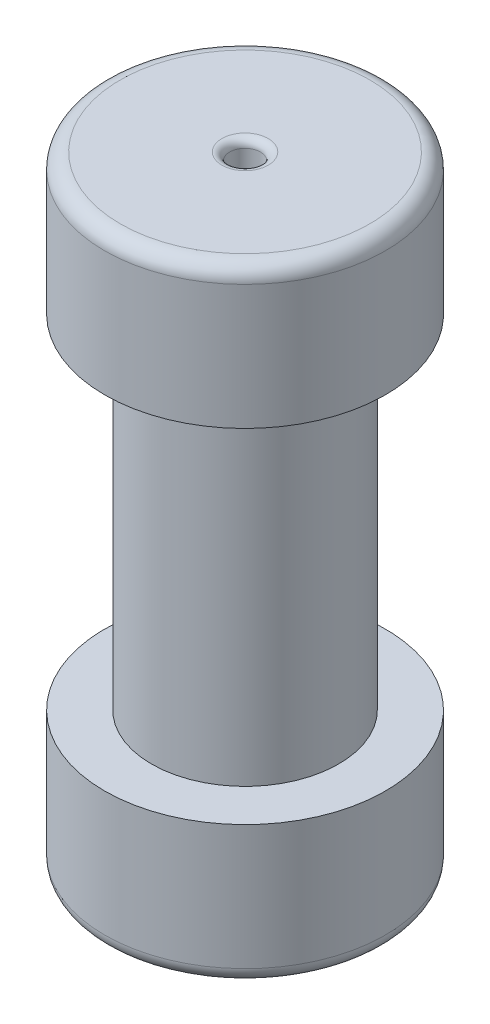
ISO-10303-21;
HEADER;
FILE_DESCRIPTION(('STEP AP214'),'2;1');
FILE_NAME('part.step','',(''),(''),'','','');
FILE_SCHEMA(('AUTOMOTIVE_DESIGN { 1 0 10303 214 1 1 1 1 }'));
ENDSEC;
DATA;
#1=APPLICATION_CONTEXT('core data for automotive mechanical design processes');
#2=APPLICATION_PROTOCOL_DEFINITION('international standard','automotive_design',2000,#1);
#3=PRODUCT_CONTEXT('',#1,'mechanical');
#4=PRODUCT('Part','Part','',(#3));
#5=PRODUCT_RELATED_PRODUCT_CATEGORY('part','',(#4));
#6=PRODUCT_DEFINITION_FORMATION('','',#4);
#7=PRODUCT_DEFINITION_CONTEXT('part definition',#1,'design');
#8=PRODUCT_DEFINITION('design','',#6,#7);
#9=PRODUCT_DEFINITION_SHAPE('','',#8);
#10=(LENGTH_UNIT() NAMED_UNIT(*) SI_UNIT(.MILLI.,.METRE.));
#11=(NAMED_UNIT(*) PLANE_ANGLE_UNIT() SI_UNIT($,.RADIAN.));
#12=(NAMED_UNIT(*) SI_UNIT($,.STERADIAN.) SOLID_ANGLE_UNIT());
#13=UNCERTAINTY_MEASURE_WITH_UNIT(LENGTH_MEASURE(1.E-05),#10,'distance_accuracy_value','');
#14=(GEOMETRIC_REPRESENTATION_CONTEXT(3) GLOBAL_UNCERTAINTY_ASSIGNED_CONTEXT((#13)) GLOBAL_UNIT_ASSIGNED_CONTEXT((#10,
#11,#12)) REPRESENTATION_CONTEXT('',''));
#15=CARTESIAN_POINT('',(0.,0.,0.));
#16=DIRECTION('',(0.,0.,1.));
#17=DIRECTION('',(1.,0.,0.));
#18=AXIS2_PLACEMENT_3D('',#15,#16,#17);
#19=CARTESIAN_POINT('',(0.,22.86,0.));
#20=DIRECTION('',(0.,-1.,0.));
#21=DIRECTION('',(0.,0.,-1.));
#22=AXIS2_PLACEMENT_3D('',#19,#20,#21);
#23=CYLINDRICAL_SURFACE('',#22,22.86);
#24=CARTESIAN_POINT('',(0.,2.54,0.));
#25=DIRECTION('',(0.,1.,0.));
#26=DIRECTION('',(0.,0.,1.));
#27=AXIS2_PLACEMENT_3D('',#24,#25,#26);
#28=CIRCLE('',#27,22.86);
#29=CARTESIAN_POINT('',(0.,2.54,22.86));
#30=VERTEX_POINT('',#29);
#31=EDGE_CURVE('E75',#30,#30,#28,.T.);
#32=ORIENTED_EDGE('',*,*,#31,.T.);
#33=EDGE_LOOP('',(#32));
#34=FACE_BOUND('',#33,.T.);
#35=CARTESIAN_POINT('',(0.,22.86,0.));
#36=DIRECTION('',(0.,1.,0.));
#37=DIRECTION('',(0.,0.,1.));
#38=AXIS2_PLACEMENT_3D('',#35,#36,#37);
#39=CIRCLE('',#38,22.86);
#40=CARTESIAN_POINT('',(0.,22.86,22.86));
#41=VERTEX_POINT('',#40);
#42=EDGE_CURVE('E80',#41,#41,#39,.T.);
#43=ORIENTED_EDGE('',*,*,#42,.F.);
#44=EDGE_LOOP('',(#43));
#45=FACE_BOUND('',#44,.T.);
#46=ADVANCED_FACE('F43',(#34,#45),#23,.T.);
#47=CARTESIAN_POINT('',(0.,22.86,0.));
#48=DIRECTION('',(0.,1.,0.));
#49=DIRECTION('',(0.,0.,1.));
#50=AXIS2_PLACEMENT_3D('',#47,#48,#49);
#51=PLANE('',#50);
#52=CARTESIAN_POINT('',(0.,22.86,0.));
#53=DIRECTION('',(0.,1.,0.));
#54=DIRECTION('',(0.,0.,1.));
#55=AXIS2_PLACEMENT_3D('',#52,#53,#54);
#56=CIRCLE('',#55,15.24);
#57=CARTESIAN_POINT('',(0.,22.86,15.24));
#58=VERTEX_POINT('',#57);
#59=EDGE_CURVE('E79',#58,#58,#56,.T.);
#60=ORIENTED_EDGE('',*,*,#59,.F.);
#61=EDGE_LOOP('',(#60));
#62=FACE_BOUND('',#61,.T.);
#63=ORIENTED_EDGE('',*,*,#42,.T.);
#64=EDGE_LOOP('',(#63));
#65=FACE_BOUND('',#64,.T.);
#66=ADVANCED_FACE('F119',(#62,#65),#51,.T.);
#67=CARTESIAN_POINT('',(0.,0.,0.));
#68=DIRECTION('',(0.,1.,0.));
#69=DIRECTION('',(0.,0.,1.));
#70=AXIS2_PLACEMENT_3D('',#67,#68,#69);
#71=PLANE('',#70);
#72=CARTESIAN_POINT('',(0.,0.,0.));
#73=DIRECTION('',(0.,1.,0.));
#74=DIRECTION('',(0.,0.,1.));
#75=AXIS2_PLACEMENT_3D('',#72,#73,#74);
#76=CIRCLE('',#75,3.175);
#77=CARTESIAN_POINT('',(0.,0.,3.175));
#78=VERTEX_POINT('',#77);
#79=EDGE_CURVE('E10',#78,#78,#76,.F.);
#80=ORIENTED_EDGE('',*,*,#79,.F.);
#81=EDGE_LOOP('',(#80));
#82=FACE_BOUND('',#81,.T.);
#83=CARTESIAN_POINT('',(0.,0.,0.));
#84=DIRECTION('',(0.,1.,0.));
#85=DIRECTION('',(0.,0.,1.));
#86=AXIS2_PLACEMENT_3D('',#83,#84,#85);
#87=CIRCLE('',#86,20.32);
#88=CARTESIAN_POINT('',(0.,0.,20.32));
#89=VERTEX_POINT('',#88);
#90=EDGE_CURVE('E71',#89,#89,#87,.F.);
#91=ORIENTED_EDGE('',*,*,#90,.T.);
#92=EDGE_LOOP('',(#91));
#93=FACE_BOUND('',#92,.T.);
#94=ADVANCED_FACE('F127',(#82,#93),#71,.F.);
#95=CARTESIAN_POINT('',(0.,78.74,0.));
#96=DIRECTION('',(0.,-1.,0.));
#97=DIRECTION('',(0.,0.,-1.));
#98=AXIS2_PLACEMENT_3D('',#95,#96,#97);
#99=CYLINDRICAL_SURFACE('',#98,15.24);
#100=CARTESIAN_POINT('',(0.,78.74,0.));
#101=DIRECTION('',(0.,1.,0.));
#102=DIRECTION('',(0.,0.,1.));
#103=AXIS2_PLACEMENT_3D('',#100,#101,#102);
#104=CIRCLE('',#103,15.24);
#105=CARTESIAN_POINT('',(0.,78.74,15.24));
#106=VERTEX_POINT('',#105);
#107=EDGE_CURVE('E84',#106,#106,#104,.T.);
#108=ORIENTED_EDGE('',*,*,#107,.F.);
#109=EDGE_LOOP('',(#108));
#110=FACE_BOUND('',#109,.T.);
#111=ORIENTED_EDGE('',*,*,#59,.T.);
#112=EDGE_LOOP('',(#111));
#113=FACE_BOUND('',#112,.T.);
#114=ADVANCED_FACE('F159',(#110,#113),#99,.T.);
#115=CARTESIAN_POINT('',(0.,101.6,0.));
#116=DIRECTION('',(0.,-1.,0.));
#117=DIRECTION('',(0.,0.,-1.));
#118=AXIS2_PLACEMENT_3D('',#115,#116,#117);
#119=CYLINDRICAL_SURFACE('',#118,22.86);
#120=CARTESIAN_POINT('',(0.,99.06,0.));
#121=DIRECTION('',(0.,1.,0.));
#122=DIRECTION('',(0.,0.,1.));
#123=AXIS2_PLACEMENT_3D('',#120,#121,#122);
#124=CIRCLE('',#123,22.86);
#125=CARTESIAN_POINT('',(0.,99.06,22.86));
#126=VERTEX_POINT('',#125);
#127=EDGE_CURVE('E61',#126,#126,#124,.F.);
#128=ORIENTED_EDGE('',*,*,#127,.T.);
#129=EDGE_LOOP('',(#128));
#130=FACE_BOUND('',#129,.T.);
#131=CARTESIAN_POINT('',(0.,78.74,0.));
#132=DIRECTION('',(0.,1.,0.));
#133=DIRECTION('',(0.,0.,1.));
#134=AXIS2_PLACEMENT_3D('',#131,#132,#133);
#135=CIRCLE('',#134,22.86);
#136=CARTESIAN_POINT('',(0.,78.74,22.86));
#137=VERTEX_POINT('',#136);
#138=EDGE_CURVE('E91',#137,#137,#135,.T.);
#139=ORIENTED_EDGE('',*,*,#138,.T.);
#140=EDGE_LOOP('',(#139));
#141=FACE_BOUND('',#140,.T.);
#142=ADVANCED_FACE('F153',(#130,#141),#119,.T.);
#143=CARTESIAN_POINT('',(0.,101.6,0.));
#144=DIRECTION('',(0.,1.,0.));
#145=DIRECTION('',(0.,0.,1.));
#146=AXIS2_PLACEMENT_3D('',#143,#144,#145);
#147=PLANE('',#146);
#148=CARTESIAN_POINT('',(0.,101.6,0.));
#149=DIRECTION('',(0.,1.,0.));
#150=DIRECTION('',(0.,0.,1.));
#151=AXIS2_PLACEMENT_3D('',#148,#149,#150);
#152=CIRCLE('',#151,3.77);
#153=CARTESIAN_POINT('',(0.,101.6,3.77));
#154=VERTEX_POINT('',#153);
#155=EDGE_CURVE('E51',#154,#154,#152,.F.);
#156=ORIENTED_EDGE('',*,*,#155,.T.);
#157=EDGE_LOOP('',(#156));
#158=FACE_BOUND('',#157,.T.);
#159=CARTESIAN_POINT('',(0.,101.6,0.));
#160=DIRECTION('',(0.,1.,0.));
#161=DIRECTION('',(0.,0.,1.));
#162=AXIS2_PLACEMENT_3D('',#159,#160,#161);
#163=CIRCLE('',#162,20.32);
#164=CARTESIAN_POINT('',(0.,101.6,20.32));
#165=VERTEX_POINT('',#164);
#166=EDGE_CURVE('E67',#165,#165,#163,.T.);
#167=ORIENTED_EDGE('',*,*,#166,.T.);
#168=EDGE_LOOP('',(#167));
#169=FACE_BOUND('',#168,.T.);
#170=ADVANCED_FACE('F151',(#158,#169),#147,.T.);
#171=CARTESIAN_POINT('',(0.,78.74,0.));
#172=DIRECTION('',(0.,1.,0.));
#173=DIRECTION('',(0.,0.,1.));
#174=AXIS2_PLACEMENT_3D('',#171,#172,#173);
#175=PLANE('',#174);
#176=ORIENTED_EDGE('',*,*,#107,.T.);
#177=EDGE_LOOP('',(#176));
#178=FACE_BOUND('',#177,.T.);
#179=ORIENTED_EDGE('',*,*,#138,.F.);
#180=EDGE_LOOP('',(#179));
#181=FACE_BOUND('',#180,.T.);
#182=ADVANCED_FACE('F136',(#178,#181),#175,.F.);
#183=CARTESIAN_POINT('',(0.,2.54,0.));
#184=DIRECTION('',(0.,1.,0.));
#185=DIRECTION('',(0.,0.,1.));
#186=AXIS2_PLACEMENT_3D('',#183,#184,#185);
#187=TOROIDAL_SURFACE('',#186,20.32,2.54);
#188=ORIENTED_EDGE('',*,*,#90,.F.);
#189=EDGE_LOOP('',(#188));
#190=FACE_BOUND('',#189,.T.);
#191=ORIENTED_EDGE('',*,*,#31,.F.);
#192=EDGE_LOOP('',(#191));
#193=FACE_BOUND('',#192,.T.);
#194=ADVANCED_FACE('F133',(#190,#193),#187,.T.);
#195=CARTESIAN_POINT('',(0.,99.06,0.));
#196=DIRECTION('',(0.,1.,0.));
#197=DIRECTION('',(0.,0.,1.));
#198=AXIS2_PLACEMENT_3D('',#195,#196,#197);
#199=TOROIDAL_SURFACE('',#198,20.32,2.54);
#200=ORIENTED_EDGE('',*,*,#127,.F.);
#201=EDGE_LOOP('',(#200));
#202=FACE_BOUND('',#201,.T.);
#203=ORIENTED_EDGE('',*,*,#166,.F.);
#204=EDGE_LOOP('',(#203));
#205=FACE_BOUND('',#204,.T.);
#206=ADVANCED_FACE('F135',(#202,#205),#199,.T.);
#207=CARTESIAN_POINT('',(0.,94.6,0.));
#208=DIRECTION('',(0.,1.,0.));
#209=DIRECTION('',(0.,0.,1.));
#210=AXIS2_PLACEMENT_3D('',#207,#208,#209);
#211=CYLINDRICAL_SURFACE('',#210,2.5);
#212=CARTESIAN_POINT('',(0.,100.33,0.));
#213=DIRECTION('',(0.,1.,0.));
#214=DIRECTION('',(0.,0.,1.));
#215=AXIS2_PLACEMENT_3D('',#212,#213,#214);
#216=CIRCLE('',#215,2.5);
#217=CARTESIAN_POINT('',(0.,100.33,2.5));
#218=VERTEX_POINT('',#217);
#219=EDGE_CURVE('E56',#218,#218,#216,.T.);
#220=ORIENTED_EDGE('',*,*,#219,.T.);
#221=EDGE_LOOP('',(#220));
#222=FACE_BOUND('',#221,.T.);
#223=CARTESIAN_POINT('',(0.,94.6,0.));
#224=DIRECTION('',(0.,1.,0.));
#225=DIRECTION('',(0.,0.,1.));
#226=AXIS2_PLACEMENT_3D('',#223,#224,#225);
#227=CIRCLE('',#226,2.5);
#228=CARTESIAN_POINT('',(0.,94.6,2.5));
#229=VERTEX_POINT('',#228);
#230=EDGE_CURVE('E95',#229,#229,#227,.T.);
#231=ORIENTED_EDGE('',*,*,#230,.F.);
#232=EDGE_LOOP('',(#231));
#233=FACE_BOUND('',#232,.T.);
#234=ADVANCED_FACE('F139',(#222,#233),#211,.F.);
#235=CARTESIAN_POINT('',(0.,94.6,0.));
#236=DIRECTION('',(0.,1.,0.));
#237=DIRECTION('',(0.,0.,1.));
#238=AXIS2_PLACEMENT_3D('',#235,#236,#237);
#239=PLANE('',#238);
#240=ORIENTED_EDGE('',*,*,#230,.T.);
#241=EDGE_LOOP('',(#240));
#242=FACE_BOUND('',#241,.T.);
#243=ADVANCED_FACE('F115',(#242),#239,.T.);
#244=CARTESIAN_POINT('',(0.,100.33,0.));
#245=DIRECTION('',(0.,1.,0.));
#246=DIRECTION('',(0.,0.,1.));
#247=AXIS2_PLACEMENT_3D('',#244,#245,#246);
#248=TOROIDAL_SURFACE('',#247,3.77,1.27);
#249=ORIENTED_EDGE('',*,*,#155,.F.);
#250=EDGE_LOOP('',(#249));
#251=FACE_BOUND('',#250,.T.);
#252=ORIENTED_EDGE('',*,*,#219,.F.);
#253=EDGE_LOOP('',(#252));
#254=FACE_BOUND('',#253,.T.);
#255=ADVANCED_FACE('F45',(#251,#254),#248,.T.);
#256=CARTESIAN_POINT('',(0.,-12.7,0.));
#257=DIRECTION('',(0.,1.,0.));
#258=DIRECTION('',(0.,0.,1.));
#259=AXIS2_PLACEMENT_3D('',#256,#257,#258);
#260=CYLINDRICAL_SURFACE('',#259,3.175);
#261=CARTESIAN_POINT('',(0.,-12.7,0.));
#262=DIRECTION('',(0.,-1.,0.));
#263=DIRECTION('',(0.,0.,-1.));
#264=AXIS2_PLACEMENT_3D('',#261,#262,#263);
#265=CIRCLE('',#264,3.175);
#266=CARTESIAN_POINT('',(0.,-12.7,-3.175));
#267=VERTEX_POINT('',#266);
#268=EDGE_CURVE('E99',#267,#267,#265,.T.);
#269=ORIENTED_EDGE('',*,*,#268,.F.);
#270=EDGE_LOOP('',(#269));
#271=FACE_BOUND('',#270,.T.);
#272=ORIENTED_EDGE('',*,*,#79,.T.);
#273=EDGE_LOOP('',(#272));
#274=FACE_BOUND('',#273,.T.);
#275=ADVANCED_FACE('F106',(#271,#274),#260,.T.);
#276=CARTESIAN_POINT('',(0.,-12.7,0.));
#277=DIRECTION('',(0.,-1.,0.));
#278=DIRECTION('',(0.,0.,-1.));
#279=AXIS2_PLACEMENT_3D('',#276,#277,#278);
#280=PLANE('',#279);
#281=ORIENTED_EDGE('',*,*,#268,.T.);
#282=EDGE_LOOP('',(#281));
#283=FACE_BOUND('',#282,.T.);
#284=ADVANCED_FACE('F104',(#283),#280,.T.);
#285=CLOSED_SHELL('',(#46,#66,#94,#114,#142,#170,#182,#194,#206,#234,#243,#255,#275,#284));
#286=MANIFOLD_SOLID_BREP('B2',#285);
#287=ADVANCED_BREP_SHAPE_REPRESENTATION('',(#18,#286),#14);
#288=SHAPE_DEFINITION_REPRESENTATION(#9,#287);
ENDSEC;
END-ISO-10303-21;
